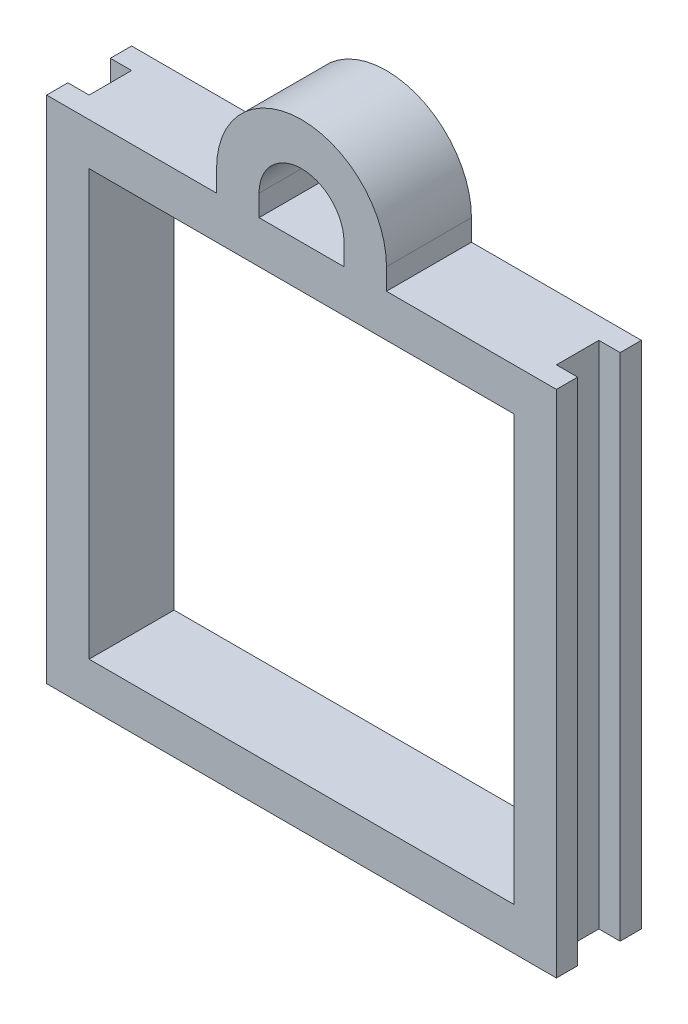
ISO-10303-21;
HEADER;
FILE_DESCRIPTION(('STEP AP214'),'2;1');
FILE_NAME('part.step','',(''),(''),'','','');
FILE_SCHEMA(('AUTOMOTIVE_DESIGN { 1 0 10303 214 1 1 1 1 }'));
ENDSEC;
DATA;
#1=APPLICATION_CONTEXT('core data for automotive mechanical design processes');
#2=APPLICATION_PROTOCOL_DEFINITION('international standard','automotive_design',2000,#1);
#3=PRODUCT_CONTEXT('',#1,'mechanical');
#4=PRODUCT('Part','Part','',(#3));
#5=PRODUCT_RELATED_PRODUCT_CATEGORY('part','',(#4));
#6=PRODUCT_DEFINITION_FORMATION('','',#4);
#7=PRODUCT_DEFINITION_CONTEXT('part definition',#1,'design');
#8=PRODUCT_DEFINITION('design','',#6,#7);
#9=PRODUCT_DEFINITION_SHAPE('','',#8);
#10=(LENGTH_UNIT() NAMED_UNIT(*) SI_UNIT(.MILLI.,.METRE.));
#11=(NAMED_UNIT(*) PLANE_ANGLE_UNIT() SI_UNIT($,.RADIAN.));
#12=(NAMED_UNIT(*) SI_UNIT($,.STERADIAN.) SOLID_ANGLE_UNIT());
#13=UNCERTAINTY_MEASURE_WITH_UNIT(LENGTH_MEASURE(1.E-05),#10,'distance_accuracy_value','');
#14=(GEOMETRIC_REPRESENTATION_CONTEXT(3) GLOBAL_UNCERTAINTY_ASSIGNED_CONTEXT((#13)) GLOBAL_UNIT_ASSIGNED_CONTEXT((#10,
#11,#12)) REPRESENTATION_CONTEXT('',''));
#15=CARTESIAN_POINT('',(0.,0.,0.));
#16=DIRECTION('',(0.,0.,1.));
#17=DIRECTION('',(1.,0.,0.));
#18=AXIS2_PLACEMENT_3D('',#15,#16,#17);
#19=CARTESIAN_POINT('',(0.,110.,-10.));
#20=DIRECTION('',(0.,-1.,0.));
#21=DIRECTION('',(0.,0.,-1.));
#22=AXIS2_PLACEMENT_3D('',#19,#20,#21);
#23=PLANE('',#22);
#24=DIRECTION('',(0.,0.,1.));
#25=VECTOR('',#24,1.);
#26=CARTESIAN_POINT('',(30.,110.,-10.));
#27=LINE('',#26,#25);
#28=CARTESIAN_POINT('',(30.,110.,-10.));
#29=VERTEX_POINT('',#28);
#30=CARTESIAN_POINT('',(30.,110.,10.));
#31=VERTEX_POINT('',#30);
#32=EDGE_CURVE('E199',#29,#31,#27,.T.);
#33=ORIENTED_EDGE('',*,*,#32,.F.);
#34=DIRECTION('',(1.,0.,0.));
#35=VECTOR('',#34,1.);
#36=CARTESIAN_POINT('',(0.,110.,-10.));
#37=LINE('',#36,#35);
#38=CARTESIAN_POINT('',(-10.,110.,-10.));
#39=VERTEX_POINT('',#38);
#40=EDGE_CURVE('E309',#39,#29,#37,.T.);
#41=ORIENTED_EDGE('',*,*,#40,.F.);
#42=DIRECTION('',(0.,0.,1.));
#43=VECTOR('',#42,1.);
#44=CARTESIAN_POINT('',(-10.,110.,-10.));
#45=LINE('',#44,#43);
#46=CARTESIAN_POINT('',(-10.,110.,-5.));
#47=VERTEX_POINT('',#46);
#48=EDGE_CURVE('E341',#39,#47,#45,.T.);
#49=ORIENTED_EDGE('',*,*,#48,.T.);
#50=DIRECTION('',(-1.,0.,0.));
#51=VECTOR('',#50,1.);
#52=CARTESIAN_POINT('',(-5.,110.,-5.));
#53=LINE('',#52,#51);
#54=CARTESIAN_POINT('',(-5.,110.,-5.));
#55=VERTEX_POINT('',#54);
#56=EDGE_CURVE('E274',#55,#47,#53,.T.);
#57=ORIENTED_EDGE('',*,*,#56,.F.);
#58=DIRECTION('',(0.,0.,-1.));
#59=VECTOR('',#58,1.);
#60=CARTESIAN_POINT('',(-5.,110.,-5.));
#61=LINE('',#60,#59);
#62=CARTESIAN_POINT('',(-5.,110.,5.));
#63=VERTEX_POINT('',#62);
#64=EDGE_CURVE('E263',#63,#55,#61,.T.);
#65=ORIENTED_EDGE('',*,*,#64,.F.);
#66=DIRECTION('',(-1.,0.,0.));
#67=VECTOR('',#66,1.);
#68=CARTESIAN_POINT('',(-5.,110.,5.));
#69=LINE('',#68,#67);
#70=CARTESIAN_POINT('',(-10.,110.,5.));
#71=VERTEX_POINT('',#70);
#72=EDGE_CURVE('E277',#63,#71,#69,.T.);
#73=ORIENTED_EDGE('',*,*,#72,.T.);
#74=CARTESIAN_POINT('',(-10.,110.,10.));
#75=VERTEX_POINT('',#74);
#76=EDGE_CURVE('E343',#71,#75,#45,.T.);
#77=ORIENTED_EDGE('',*,*,#76,.T.);
#78=DIRECTION('',(1.,0.,0.));
#79=VECTOR('',#78,1.);
#80=CARTESIAN_POINT('',(0.,110.,10.));
#81=LINE('',#80,#79);
#82=EDGE_CURVE('E188',#75,#31,#81,.T.);
#83=ORIENTED_EDGE('',*,*,#82,.T.);
#84=EDGE_LOOP('',(#33,#41,#49,#57,#65,#73,#77,#83));
#85=FACE_BOUND('',#84,.T.);
#86=ADVANCED_FACE('F16',(#85),#23,.F.);
#87=CARTESIAN_POINT('',(70.,110.,-10.));
#88=VERTEX_POINT('',#87);
#89=CARTESIAN_POINT('',(110.,110.,-10.));
#90=VERTEX_POINT('',#89);
#91=EDGE_CURVE('E33',#88,#90,#37,.T.);
#92=ORIENTED_EDGE('',*,*,#91,.F.);
#93=DIRECTION('',(0.,0.,1.));
#94=VECTOR('',#93,1.);
#95=CARTESIAN_POINT('',(70.,110.,-10.));
#96=LINE('',#95,#94);
#97=CARTESIAN_POINT('',(70.,110.,10.));
#98=VERTEX_POINT('',#97);
#99=EDGE_CURVE('E235',#88,#98,#96,.T.);
#100=ORIENTED_EDGE('',*,*,#99,.T.);
#101=CARTESIAN_POINT('',(110.,110.,10.));
#102=VERTEX_POINT('',#101);
#103=EDGE_CURVE('E189',#98,#102,#81,.T.);
#104=ORIENTED_EDGE('',*,*,#103,.T.);
#105=DIRECTION('',(0.,0.,1.));
#106=VECTOR('',#105,1.);
#107=CARTESIAN_POINT('',(110.,110.,-10.));
#108=LINE('',#107,#106);
#109=CARTESIAN_POINT('',(110.,110.,5.));
#110=VERTEX_POINT('',#109);
#111=EDGE_CURVE('E327',#110,#102,#108,.T.);
#112=ORIENTED_EDGE('',*,*,#111,.F.);
#113=DIRECTION('',(1.,0.,0.));
#114=VECTOR('',#113,1.);
#115=CARTESIAN_POINT('',(105.,110.,5.));
#116=LINE('',#115,#114);
#117=CARTESIAN_POINT('',(105.,110.,5.));
#118=VERTEX_POINT('',#117);
#119=EDGE_CURVE('E250',#118,#110,#116,.T.);
#120=ORIENTED_EDGE('',*,*,#119,.F.);
#121=DIRECTION('',(0.,0.,1.));
#122=VECTOR('',#121,1.);
#123=CARTESIAN_POINT('',(105.,110.,0.));
#124=LINE('',#123,#122);
#125=CARTESIAN_POINT('',(105.,110.,-5.));
#126=VERTEX_POINT('',#125);
#127=EDGE_CURVE('E239',#126,#118,#124,.T.);
#128=ORIENTED_EDGE('',*,*,#127,.F.);
#129=DIRECTION('',(1.,0.,0.));
#130=VECTOR('',#129,1.);
#131=CARTESIAN_POINT('',(105.,110.,-5.));
#132=LINE('',#131,#130);
#133=CARTESIAN_POINT('',(110.,110.,-5.));
#134=VERTEX_POINT('',#133);
#135=EDGE_CURVE('E253',#126,#134,#132,.T.);
#136=ORIENTED_EDGE('',*,*,#135,.T.);
#137=EDGE_CURVE('E20',#90,#134,#108,.T.);
#138=ORIENTED_EDGE('',*,*,#137,.F.);
#139=EDGE_LOOP('',(#92,#100,#104,#112,#120,#128,#136,#138));
#140=FACE_BOUND('',#139,.T.);
#141=ADVANCED_FACE('F376',(#140),#23,.F.);
#142=CARTESIAN_POINT('',(110.,0.,-10.));
#143=DIRECTION('',(-1.,0.,0.));
#144=DIRECTION('',(0.,0.,1.));
#145=AXIS2_PLACEMENT_3D('',#142,#143,#144);
#146=PLANE('',#145);
#147=ORIENTED_EDGE('',*,*,#137,.T.);
#148=DIRECTION('',(0.,1.,0.));
#149=VECTOR('',#148,1.);
#150=CARTESIAN_POINT('',(110.,0.,-5.));
#151=LINE('',#150,#149);
#152=CARTESIAN_POINT('',(110.,-10.,-5.));
#153=VERTEX_POINT('',#152);
#154=EDGE_CURVE('E243',#153,#134,#151,.T.);
#155=ORIENTED_EDGE('',*,*,#154,.F.);
#156=DIRECTION('',(0.,0.,1.));
#157=VECTOR('',#156,1.);
#158=CARTESIAN_POINT('',(110.,-10.,-10.));
#159=LINE('',#158,#157);
#160=CARTESIAN_POINT('',(110.,-10.,-10.));
#161=VERTEX_POINT('',#160);
#162=EDGE_CURVE('E334',#161,#153,#159,.T.);
#163=ORIENTED_EDGE('',*,*,#162,.F.);
#164=DIRECTION('',(0.,-1.,0.));
#165=VECTOR('',#164,1.);
#166=CARTESIAN_POINT('',(110.,0.,-10.));
#167=LINE('',#166,#165);
#168=EDGE_CURVE('E307',#90,#161,#167,.T.);
#169=ORIENTED_EDGE('',*,*,#168,.F.);
#170=EDGE_LOOP('',(#147,#155,#163,#169));
#171=FACE_BOUND('',#170,.T.);
#172=ADVANCED_FACE('F378',(#171),#146,.F.);
#173=CARTESIAN_POINT('',(-10.,0.,-10.));
#174=DIRECTION('',(-1.,0.,0.));
#175=DIRECTION('',(0.,-1.,0.));
#176=AXIS2_PLACEMENT_3D('',#173,#174,#175);
#177=PLANE('',#176);
#178=DIRECTION('',(0.,1.,0.));
#179=VECTOR('',#178,1.);
#180=CARTESIAN_POINT('',(-10.,110.,5.));
#181=LINE('',#180,#179);
#182=CARTESIAN_POINT('',(-10.,-10.,5.));
#183=VERTEX_POINT('',#182);
#184=EDGE_CURVE('E267',#183,#71,#181,.T.);
#185=ORIENTED_EDGE('',*,*,#184,.F.);
#186=DIRECTION('',(0.,0.,1.));
#187=VECTOR('',#186,1.);
#188=CARTESIAN_POINT('',(-10.,-10.,-10.));
#189=LINE('',#188,#187);
#190=CARTESIAN_POINT('',(-10.,-10.,10.));
#191=VERTEX_POINT('',#190);
#192=EDGE_CURVE('E340',#183,#191,#189,.T.);
#193=ORIENTED_EDGE('',*,*,#192,.T.);
#194=DIRECTION('',(0.,-1.,0.));
#195=VECTOR('',#194,1.);
#196=CARTESIAN_POINT('',(-10.,0.,10.));
#197=LINE('',#196,#195);
#198=EDGE_CURVE('E289',#75,#191,#197,.T.);
#199=ORIENTED_EDGE('',*,*,#198,.F.);
#200=ORIENTED_EDGE('',*,*,#76,.F.);
#201=EDGE_LOOP('',(#185,#193,#199,#200));
#202=FACE_BOUND('',#201,.T.);
#203=ADVANCED_FACE('F385',(#202),#177,.T.);
#204=CARTESIAN_POINT('',(100.,0.,-10.));
#205=DIRECTION('',(1.,0.,0.));
#206=DIRECTION('',(0.,0.,-1.));
#207=AXIS2_PLACEMENT_3D('',#204,#205,#206);
#208=PLANE('',#207);
#209=DIRECTION('',(0.,0.,1.));
#210=VECTOR('',#209,1.);
#211=CARTESIAN_POINT('',(100.,0.,-10.));
#212=LINE('',#211,#210);
#213=CARTESIAN_POINT('',(100.,0.,-10.));
#214=VERTEX_POINT('',#213);
#215=CARTESIAN_POINT('',(100.,0.,10.));
#216=VERTEX_POINT('',#215);
#217=EDGE_CURVE('E332',#214,#216,#212,.T.);
#218=ORIENTED_EDGE('',*,*,#217,.T.);
#219=DIRECTION('',(0.,1.,0.));
#220=VECTOR('',#219,1.);
#221=CARTESIAN_POINT('',(100.,0.,10.));
#222=LINE('',#221,#220);
#223=CARTESIAN_POINT('',(100.,100.,10.));
#224=VERTEX_POINT('',#223);
#225=EDGE_CURVE('E295',#216,#224,#222,.T.);
#226=ORIENTED_EDGE('',*,*,#225,.T.);
#227=DIRECTION('',(0.,0.,1.));
#228=VECTOR('',#227,1.);
#229=CARTESIAN_POINT('',(100.,100.,-10.));
#230=LINE('',#229,#228);
#231=CARTESIAN_POINT('',(100.,100.,-10.));
#232=VERTEX_POINT('',#231);
#233=EDGE_CURVE('E10',#232,#224,#230,.T.);
#234=ORIENTED_EDGE('',*,*,#233,.F.);
#235=DIRECTION('',(0.,1.,0.));
#236=VECTOR('',#235,1.);
#237=CARTESIAN_POINT('',(100.,0.,-10.));
#238=LINE('',#237,#236);
#239=EDGE_CURVE('E318',#214,#232,#238,.T.);
#240=ORIENTED_EDGE('',*,*,#239,.F.);
#241=EDGE_LOOP('',(#218,#226,#234,#240));
#242=FACE_BOUND('',#241,.T.);
#243=ADVANCED_FACE('F406',(#242),#208,.F.);
#244=CARTESIAN_POINT('',(0.,100.,-10.));
#245=DIRECTION('',(0.,-1.,0.));
#246=DIRECTION('',(0.,0.,-1.));
#247=AXIS2_PLACEMENT_3D('',#244,#245,#246);
#248=PLANE('',#247);
#249=ORIENTED_EDGE('',*,*,#233,.T.);
#250=DIRECTION('',(1.,0.,0.));
#251=VECTOR('',#250,1.);
#252=CARTESIAN_POINT('',(0.,100.,10.));
#253=LINE('',#252,#251);
#254=CARTESIAN_POINT('',(0.,100.,10.));
#255=VERTEX_POINT('',#254);
#256=EDGE_CURVE('E304',#255,#224,#253,.T.);
#257=ORIENTED_EDGE('',*,*,#256,.F.);
#258=DIRECTION('',(0.,0.,1.));
#259=VECTOR('',#258,1.);
#260=CARTESIAN_POINT('',(0.,100.,-10.));
#261=LINE('',#260,#259);
#262=CARTESIAN_POINT('',(0.,100.,-10.));
#263=VERTEX_POINT('',#262);
#264=EDGE_CURVE('E25',#263,#255,#261,.T.);
#265=ORIENTED_EDGE('',*,*,#264,.F.);
#266=DIRECTION('',(1.,0.,0.));
#267=VECTOR('',#266,1.);
#268=CARTESIAN_POINT('',(0.,100.,-10.));
#269=LINE('',#268,#267);
#270=EDGE_CURVE('E325',#263,#232,#269,.T.);
#271=ORIENTED_EDGE('',*,*,#270,.T.);
#272=EDGE_LOOP('',(#249,#257,#265,#271));
#273=FACE_BOUND('',#272,.T.);
#274=ADVANCED_FACE('F412',(#273),#248,.T.);
#275=CARTESIAN_POINT('',(0.,0.,-10.));
#276=DIRECTION('',(1.,0.,0.));
#277=DIRECTION('',(0.,0.,-1.));
#278=AXIS2_PLACEMENT_3D('',#275,#276,#277);
#279=PLANE('',#278);
#280=ORIENTED_EDGE('',*,*,#264,.T.);
#281=DIRECTION('',(0.,1.,0.));
#282=VECTOR('',#281,1.);
#283=CARTESIAN_POINT('',(0.,0.,10.));
#284=LINE('',#283,#282);
#285=CARTESIAN_POINT('',(0.,0.,10.));
#286=VERTEX_POINT('',#285);
#287=EDGE_CURVE('E301',#286,#255,#284,.T.);
#288=ORIENTED_EDGE('',*,*,#287,.F.);
#289=DIRECTION('',(0.,0.,1.));
#290=VECTOR('',#289,1.);
#291=CARTESIAN_POINT('',(0.,0.,-10.));
#292=LINE('',#291,#290);
#293=CARTESIAN_POINT('',(0.,0.,-10.));
#294=VERTEX_POINT('',#293);
#295=EDGE_CURVE('E330',#294,#286,#292,.T.);
#296=ORIENTED_EDGE('',*,*,#295,.F.);
#297=DIRECTION('',(0.,1.,0.));
#298=VECTOR('',#297,1.);
#299=CARTESIAN_POINT('',(0.,0.,-10.));
#300=LINE('',#299,#298);
#301=EDGE_CURVE('E322',#294,#263,#300,.T.);
#302=ORIENTED_EDGE('',*,*,#301,.T.);
#303=EDGE_LOOP('',(#280,#288,#296,#302));
#304=FACE_BOUND('',#303,.T.);
#305=ADVANCED_FACE('F456',(#304),#279,.T.);
#306=CARTESIAN_POINT('',(110.,-10.,5.));
#307=VERTEX_POINT('',#306);
#308=CARTESIAN_POINT('',(110.,-10.,10.));
#309=VERTEX_POINT('',#308);
#310=EDGE_CURVE('E337',#307,#309,#159,.T.);
#311=ORIENTED_EDGE('',*,*,#310,.F.);
#312=DIRECTION('',(0.,-1.,0.));
#313=VECTOR('',#312,1.);
#314=CARTESIAN_POINT('',(110.,0.,5.));
#315=LINE('',#314,#313);
#316=EDGE_CURVE('E227',#110,#307,#315,.T.);
#317=ORIENTED_EDGE('',*,*,#316,.F.);
#318=ORIENTED_EDGE('',*,*,#111,.T.);
#319=DIRECTION('',(0.,-1.,0.));
#320=VECTOR('',#319,1.);
#321=CARTESIAN_POINT('',(110.,0.,10.));
#322=LINE('',#321,#320);
#323=EDGE_CURVE('E280',#102,#309,#322,.T.);
#324=ORIENTED_EDGE('',*,*,#323,.T.);
#325=EDGE_LOOP('',(#311,#317,#318,#324));
#326=FACE_BOUND('',#325,.T.);
#327=ADVANCED_FACE('F18',(#326),#146,.F.);
#328=CARTESIAN_POINT('',(0.,-10.,-10.));
#329=DIRECTION('',(0.,-1.,0.));
#330=DIRECTION('',(0.,0.,-1.));
#331=AXIS2_PLACEMENT_3D('',#328,#329,#330);
#332=PLANE('',#331);
#333=DIRECTION('',(1.,0.,0.));
#334=VECTOR('',#333,1.);
#335=CARTESIAN_POINT('',(105.,-10.,-5.));
#336=LINE('',#335,#334);
#337=CARTESIAN_POINT('',(105.,-10.,-5.));
#338=VERTEX_POINT('',#337);
#339=EDGE_CURVE('E257',#338,#153,#336,.T.);
#340=ORIENTED_EDGE('',*,*,#339,.F.);
#341=DIRECTION('',(0.,0.,-1.));
#342=VECTOR('',#341,1.);
#343=CARTESIAN_POINT('',(105.,-10.,0.));
#344=LINE('',#343,#342);
#345=CARTESIAN_POINT('',(105.,-10.,5.));
#346=VERTEX_POINT('',#345);
#347=EDGE_CURVE('E246',#346,#338,#344,.T.);
#348=ORIENTED_EDGE('',*,*,#347,.F.);
#349=DIRECTION('',(1.,0.,0.));
#350=VECTOR('',#349,1.);
#351=CARTESIAN_POINT('',(105.,-10.,5.));
#352=LINE('',#351,#350);
#353=EDGE_CURVE('E259',#346,#307,#352,.T.);
#354=ORIENTED_EDGE('',*,*,#353,.T.);
#355=ORIENTED_EDGE('',*,*,#310,.T.);
#356=DIRECTION('',(1.,0.,0.));
#357=VECTOR('',#356,1.);
#358=CARTESIAN_POINT('',(0.,-10.,10.));
#359=LINE('',#358,#357);
#360=EDGE_CURVE('E292',#191,#309,#359,.T.);
#361=ORIENTED_EDGE('',*,*,#360,.F.);
#362=ORIENTED_EDGE('',*,*,#192,.F.);
#363=DIRECTION('',(-1.,0.,0.));
#364=VECTOR('',#363,1.);
#365=CARTESIAN_POINT('',(-5.,-10.,5.));
#366=LINE('',#365,#364);
#367=CARTESIAN_POINT('',(-5.,-10.,5.));
#368=VERTEX_POINT('',#367);
#369=EDGE_CURVE('E281',#368,#183,#366,.T.);
#370=ORIENTED_EDGE('',*,*,#369,.F.);
#371=DIRECTION('',(0.,0.,1.));
#372=VECTOR('',#371,1.);
#373=CARTESIAN_POINT('',(-5.,-10.,-5.));
#374=LINE('',#373,#372);
#375=CARTESIAN_POINT('',(-5.,-10.,-5.));
#376=VERTEX_POINT('',#375);
#377=EDGE_CURVE('E270',#376,#368,#374,.T.);
#378=ORIENTED_EDGE('',*,*,#377,.F.);
#379=DIRECTION('',(-1.,0.,0.));
#380=VECTOR('',#379,1.);
#381=CARTESIAN_POINT('',(-5.,-10.,-5.));
#382=LINE('',#381,#380);
#383=CARTESIAN_POINT('',(-10.,-10.,-5.));
#384=VERTEX_POINT('',#383);
#385=EDGE_CURVE('E283',#376,#384,#382,.T.);
#386=ORIENTED_EDGE('',*,*,#385,.T.);
#387=CARTESIAN_POINT('',(-10.,-10.,-10.));
#388=VERTEX_POINT('',#387);
#389=EDGE_CURVE('E338',#388,#384,#189,.T.);
#390=ORIENTED_EDGE('',*,*,#389,.F.);
#391=DIRECTION('',(1.,0.,0.));
#392=VECTOR('',#391,1.);
#393=CARTESIAN_POINT('',(0.,-10.,-10.));
#394=LINE('',#393,#392);
#395=EDGE_CURVE('E315',#388,#161,#394,.T.);
#396=ORIENTED_EDGE('',*,*,#395,.T.);
#397=ORIENTED_EDGE('',*,*,#162,.T.);
#398=EDGE_LOOP('',(#340,#348,#354,#355,#361,#362,#370,#378,#386,#390,#396,#397));
#399=FACE_BOUND('',#398,.T.);
#400=ADVANCED_FACE('F366',(#399),#332,.T.);
#401=DIRECTION('',(0.,-1.,0.));
#402=VECTOR('',#401,1.);
#403=CARTESIAN_POINT('',(-10.,110.,-5.));
#404=LINE('',#403,#402);
#405=EDGE_CURVE('E256',#47,#384,#404,.T.);
#406=ORIENTED_EDGE('',*,*,#405,.F.);
#407=ORIENTED_EDGE('',*,*,#48,.F.);
#408=DIRECTION('',(0.,-1.,0.));
#409=VECTOR('',#408,1.);
#410=CARTESIAN_POINT('',(-10.,0.,-10.));
#411=LINE('',#410,#409);
#412=EDGE_CURVE('E312',#39,#388,#411,.T.);
#413=ORIENTED_EDGE('',*,*,#412,.T.);
#414=ORIENTED_EDGE('',*,*,#389,.T.);
#415=EDGE_LOOP('',(#406,#407,#413,#414));
#416=FACE_BOUND('',#415,.T.);
#417=ADVANCED_FACE('F389',(#416),#177,.T.);
#418=CARTESIAN_POINT('',(40.,110.,-10.));
#419=VERTEX_POINT('',#418);
#420=CARTESIAN_POINT('',(60.,110.,-10.));
#421=VERTEX_POINT('',#420);
#422=EDGE_CURVE('E194',#419,#421,#37,.T.);
#423=ORIENTED_EDGE('',*,*,#422,.F.);
#424=DIRECTION('',(0.,0.,1.));
#425=VECTOR('',#424,1.);
#426=CARTESIAN_POINT('',(40.,110.,-10.));
#427=LINE('',#426,#425);
#428=CARTESIAN_POINT('',(40.,110.,10.));
#429=VERTEX_POINT('',#428);
#430=EDGE_CURVE('E192',#419,#429,#427,.T.);
#431=ORIENTED_EDGE('',*,*,#430,.T.);
#432=CARTESIAN_POINT('',(60.,110.,10.));
#433=VERTEX_POINT('',#432);
#434=EDGE_CURVE('E179',#429,#433,#81,.T.);
#435=ORIENTED_EDGE('',*,*,#434,.T.);
#436=DIRECTION('',(0.,0.,1.));
#437=VECTOR('',#436,1.);
#438=CARTESIAN_POINT('',(60.,110.,-10.));
#439=LINE('',#438,#437);
#440=EDGE_CURVE('E41',#421,#433,#439,.T.);
#441=ORIENTED_EDGE('',*,*,#440,.F.);
#442=EDGE_LOOP('',(#423,#431,#435,#441));
#443=FACE_BOUND('',#442,.T.);
#444=ADVANCED_FACE('F193',(#443),#23,.F.);
#445=CARTESIAN_POINT('',(0.,0.,-10.));
#446=DIRECTION('',(0.,-1.,0.));
#447=DIRECTION('',(0.,0.,-1.));
#448=AXIS2_PLACEMENT_3D('',#445,#446,#447);
#449=PLANE('',#448);
#450=ORIENTED_EDGE('',*,*,#295,.T.);
#451=DIRECTION('',(1.,0.,0.));
#452=VECTOR('',#451,1.);
#453=CARTESIAN_POINT('',(0.,0.,10.));
#454=LINE('',#453,#452);
#455=EDGE_CURVE('E298',#286,#216,#454,.T.);
#456=ORIENTED_EDGE('',*,*,#455,.T.);
#457=ORIENTED_EDGE('',*,*,#217,.F.);
#458=DIRECTION('',(1.,0.,0.));
#459=VECTOR('',#458,1.);
#460=CARTESIAN_POINT('',(0.,0.,-10.));
#461=LINE('',#460,#459);
#462=EDGE_CURVE('E320',#294,#214,#461,.T.);
#463=ORIENTED_EDGE('',*,*,#462,.F.);
#464=EDGE_LOOP('',(#450,#456,#457,#463));
#465=FACE_BOUND('',#464,.T.);
#466=ADVANCED_FACE('F388',(#465),#449,.F.);
#467=CARTESIAN_POINT('',(0.,0.,-10.));
#468=DIRECTION('',(0.,0.,1.));
#469=DIRECTION('',(1.,0.,0.));
#470=AXIS2_PLACEMENT_3D('',#467,#468,#469);
#471=PLANE('',#470);
#472=DIRECTION('',(0.,1.,0.));
#473=VECTOR('',#472,1.);
#474=CARTESIAN_POINT('',(40.,0.,-10.));
#475=LINE('',#474,#473);
#476=CARTESIAN_POINT('',(40.,115.,-10.));
#477=VERTEX_POINT('',#476);
#478=EDGE_CURVE('E224',#419,#477,#475,.T.);
#479=ORIENTED_EDGE('',*,*,#478,.F.);
#480=ORIENTED_EDGE('',*,*,#422,.T.);
#481=DIRECTION('',(0.,-1.,0.));
#482=VECTOR('',#481,1.);
#483=CARTESIAN_POINT('',(60.,-1.66533453693772E-13,-10.));
#484=LINE('',#483,#482);
#485=CARTESIAN_POINT('',(60.,115.,-10.));
#486=VERTEX_POINT('',#485);
#487=EDGE_CURVE('E207',#486,#421,#484,.T.);
#488=ORIENTED_EDGE('',*,*,#487,.F.);
#489=CARTESIAN_POINT('',(50.,115.,-10.));
#490=DIRECTION('',(0.,0.,1.));
#491=DIRECTION('',(1.,0.,0.));
#492=AXIS2_PLACEMENT_3D('',#489,#490,#491);
#493=CIRCLE('',#492,10.);
#494=EDGE_CURVE('E204',#486,#477,#493,.T.);
#495=ORIENTED_EDGE('',*,*,#494,.T.);
#496=EDGE_LOOP('',(#479,#480,#488,#495));
#497=FACE_BOUND('',#496,.T.);
#498=ORIENTED_EDGE('',*,*,#168,.T.);
#499=ORIENTED_EDGE('',*,*,#395,.F.);
#500=ORIENTED_EDGE('',*,*,#412,.F.);
#501=ORIENTED_EDGE('',*,*,#40,.T.);
#502=DIRECTION('',(0.,1.,0.));
#503=VECTOR('',#502,1.);
#504=CARTESIAN_POINT('',(30.,0.,-10.));
#505=LINE('',#504,#503);
#506=CARTESIAN_POINT('',(30.,115.,-10.));
#507=VERTEX_POINT('',#506);
#508=EDGE_CURVE('E222',#29,#507,#505,.T.);
#509=ORIENTED_EDGE('',*,*,#508,.T.);
#510=CARTESIAN_POINT('',(50.,115.,-10.));
#511=DIRECTION('',(0.,0.,1.));
#512=DIRECTION('',(1.,0.,0.));
#513=AXIS2_PLACEMENT_3D('',#510,#511,#512);
#514=CIRCLE('',#513,20.);
#515=CARTESIAN_POINT('',(70.,115.,-10.));
#516=VERTEX_POINT('',#515);
#517=EDGE_CURVE('E220',#507,#516,#514,.F.);
#518=ORIENTED_EDGE('',*,*,#517,.T.);
#519=DIRECTION('',(0.,1.,0.));
#520=VECTOR('',#519,1.);
#521=CARTESIAN_POINT('',(70.,0.,-10.));
#522=LINE('',#521,#520);
#523=EDGE_CURVE('E217',#88,#516,#522,.T.);
#524=ORIENTED_EDGE('',*,*,#523,.F.);
#525=ORIENTED_EDGE('',*,*,#91,.T.);
#526=EDGE_LOOP('',(#498,#499,#500,#501,#509,#518,#524,#525));
#527=FACE_BOUND('',#526,.T.);
#528=ORIENTED_EDGE('',*,*,#239,.T.);
#529=ORIENTED_EDGE('',*,*,#270,.F.);
#530=ORIENTED_EDGE('',*,*,#301,.F.);
#531=ORIENTED_EDGE('',*,*,#462,.T.);
#532=EDGE_LOOP('',(#528,#529,#530,#531));
#533=FACE_BOUND('',#532,.T.);
#534=ADVANCED_FACE('F395',(#497,#527,#533),#471,.F.);
#535=CARTESIAN_POINT('',(0.,0.,10.));
#536=DIRECTION('',(0.,0.,1.));
#537=DIRECTION('',(1.,0.,0.));
#538=AXIS2_PLACEMENT_3D('',#535,#536,#537);
#539=PLANE('',#538);
#540=ORIENTED_EDGE('',*,*,#434,.F.);
#541=DIRECTION('',(0.,1.,0.));
#542=VECTOR('',#541,1.);
#543=CARTESIAN_POINT('',(40.,0.,10.));
#544=LINE('',#543,#542);
#545=CARTESIAN_POINT('',(40.,115.,10.));
#546=VERTEX_POINT('',#545);
#547=EDGE_CURVE('E185',#429,#546,#544,.T.);
#548=ORIENTED_EDGE('',*,*,#547,.T.);
#549=CARTESIAN_POINT('',(50.,115.,10.));
#550=DIRECTION('',(0.,0.,1.));
#551=DIRECTION('',(1.,0.,0.));
#552=AXIS2_PLACEMENT_3D('',#549,#550,#551);
#553=CIRCLE('',#552,10.);
#554=CARTESIAN_POINT('',(60.,115.,10.));
#555=VERTEX_POINT('',#554);
#556=EDGE_CURVE('E212',#555,#546,#553,.T.);
#557=ORIENTED_EDGE('',*,*,#556,.F.);
#558=DIRECTION('',(0.,-1.,0.));
#559=VECTOR('',#558,1.);
#560=CARTESIAN_POINT('',(60.,-1.66533453693772E-13,10.));
#561=LINE('',#560,#559);
#562=EDGE_CURVE('E187',#555,#433,#561,.T.);
#563=ORIENTED_EDGE('',*,*,#562,.T.);
#564=EDGE_LOOP('',(#540,#548,#557,#563));
#565=FACE_BOUND('',#564,.T.);
#566=ORIENTED_EDGE('',*,*,#323,.F.);
#567=ORIENTED_EDGE('',*,*,#103,.F.);
#568=DIRECTION('',(0.,1.,0.));
#569=VECTOR('',#568,1.);
#570=CARTESIAN_POINT('',(70.,0.,10.));
#571=LINE('',#570,#569);
#572=CARTESIAN_POINT('',(70.,115.,10.));
#573=VERTEX_POINT('',#572);
#574=EDGE_CURVE('E205',#98,#573,#571,.T.);
#575=ORIENTED_EDGE('',*,*,#574,.T.);
#576=CARTESIAN_POINT('',(50.,115.,10.));
#577=DIRECTION('',(0.,0.,1.));
#578=DIRECTION('',(1.,0.,0.));
#579=AXIS2_PLACEMENT_3D('',#576,#577,#578);
#580=CIRCLE('',#579,20.);
#581=CARTESIAN_POINT('',(30.,115.,10.));
#582=VERTEX_POINT('',#581);
#583=EDGE_CURVE('E620',#582,#573,#580,.F.);
#584=ORIENTED_EDGE('',*,*,#583,.F.);
#585=DIRECTION('',(0.,1.,0.));
#586=VECTOR('',#585,1.);
#587=CARTESIAN_POINT('',(30.,0.,10.));
#588=LINE('',#587,#586);
#589=EDGE_CURVE('E622',#31,#582,#588,.T.);
#590=ORIENTED_EDGE('',*,*,#589,.F.);
#591=ORIENTED_EDGE('',*,*,#82,.F.);
#592=ORIENTED_EDGE('',*,*,#198,.T.);
#593=ORIENTED_EDGE('',*,*,#360,.T.);
#594=EDGE_LOOP('',(#566,#567,#575,#584,#590,#591,#592,#593));
#595=FACE_BOUND('',#594,.T.);
#596=ORIENTED_EDGE('',*,*,#225,.F.);
#597=ORIENTED_EDGE('',*,*,#455,.F.);
#598=ORIENTED_EDGE('',*,*,#287,.T.);
#599=ORIENTED_EDGE('',*,*,#256,.T.);
#600=EDGE_LOOP('',(#596,#597,#598,#599));
#601=FACE_BOUND('',#600,.T.);
#602=ADVANCED_FACE('F181',(#565,#595,#601),#539,.T.);
#603=CARTESIAN_POINT('',(-5.,110.,5.));
#604=DIRECTION('',(0.,0.,1.));
#605=DIRECTION('',(0.,-1.,0.));
#606=AXIS2_PLACEMENT_3D('',#603,#604,#605);
#607=PLANE('',#606);
#608=ORIENTED_EDGE('',*,*,#184,.T.);
#609=ORIENTED_EDGE('',*,*,#72,.F.);
#610=DIRECTION('',(0.,1.,0.));
#611=VECTOR('',#610,1.);
#612=CARTESIAN_POINT('',(-5.,110.,5.));
#613=LINE('',#612,#611);
#614=EDGE_CURVE('E272',#368,#63,#613,.T.);
#615=ORIENTED_EDGE('',*,*,#614,.F.);
#616=ORIENTED_EDGE('',*,*,#369,.T.);
#617=EDGE_LOOP('',(#608,#609,#615,#616));
#618=FACE_BOUND('',#617,.T.);
#619=ADVANCED_FACE('F418',(#618),#607,.F.);
#620=CARTESIAN_POINT('',(-5.,110.,-5.));
#621=DIRECTION('',(0.,0.,-1.));
#622=DIRECTION('',(0.,1.,0.));
#623=AXIS2_PLACEMENT_3D('',#620,#621,#622);
#624=PLANE('',#623);
#625=ORIENTED_EDGE('',*,*,#405,.T.);
#626=ORIENTED_EDGE('',*,*,#385,.F.);
#627=DIRECTION('',(0.,-1.,0.));
#628=VECTOR('',#627,1.);
#629=CARTESIAN_POINT('',(-5.,110.,-5.));
#630=LINE('',#629,#628);
#631=EDGE_CURVE('E266',#55,#376,#630,.T.);
#632=ORIENTED_EDGE('',*,*,#631,.F.);
#633=ORIENTED_EDGE('',*,*,#56,.T.);
#634=EDGE_LOOP('',(#625,#626,#632,#633));
#635=FACE_BOUND('',#634,.T.);
#636=ADVANCED_FACE('F440',(#635),#624,.F.);
#637=CARTESIAN_POINT('',(-5.,0.,0.));
#638=DIRECTION('',(1.,0.,0.));
#639=DIRECTION('',(0.,1.,0.));
#640=AXIS2_PLACEMENT_3D('',#637,#638,#639);
#641=PLANE('',#640);
#642=ORIENTED_EDGE('',*,*,#64,.T.);
#643=ORIENTED_EDGE('',*,*,#631,.T.);
#644=ORIENTED_EDGE('',*,*,#377,.T.);
#645=ORIENTED_EDGE('',*,*,#614,.T.);
#646=EDGE_LOOP('',(#642,#643,#644,#645));
#647=FACE_BOUND('',#646,.T.);
#648=ADVANCED_FACE('F422',(#647),#641,.F.);
#649=CARTESIAN_POINT('',(105.,0.,-5.));
#650=DIRECTION('',(0.,0.,-1.));
#651=DIRECTION('',(0.,1.,0.));
#652=AXIS2_PLACEMENT_3D('',#649,#650,#651);
#653=PLANE('',#652);
#654=ORIENTED_EDGE('',*,*,#154,.T.);
#655=ORIENTED_EDGE('',*,*,#135,.F.);
#656=DIRECTION('',(0.,1.,0.));
#657=VECTOR('',#656,1.);
#658=CARTESIAN_POINT('',(105.,0.,-5.));
#659=LINE('',#658,#657);
#660=EDGE_CURVE('E248',#338,#126,#659,.T.);
#661=ORIENTED_EDGE('',*,*,#660,.F.);
#662=ORIENTED_EDGE('',*,*,#339,.T.);
#663=EDGE_LOOP('',(#654,#655,#661,#662));
#664=FACE_BOUND('',#663,.T.);
#665=ADVANCED_FACE('F431',(#664),#653,.F.);
#666=CARTESIAN_POINT('',(105.,0.,5.));
#667=DIRECTION('',(0.,0.,1.));
#668=DIRECTION('',(1.,0.,0.));
#669=AXIS2_PLACEMENT_3D('',#666,#667,#668);
#670=PLANE('',#669);
#671=ORIENTED_EDGE('',*,*,#316,.T.);
#672=ORIENTED_EDGE('',*,*,#353,.F.);
#673=DIRECTION('',(0.,-1.,0.));
#674=VECTOR('',#673,1.);
#675=CARTESIAN_POINT('',(105.,0.,5.));
#676=LINE('',#675,#674);
#677=EDGE_CURVE('E242',#118,#346,#676,.T.);
#678=ORIENTED_EDGE('',*,*,#677,.F.);
#679=ORIENTED_EDGE('',*,*,#119,.T.);
#680=EDGE_LOOP('',(#671,#672,#678,#679));
#681=FACE_BOUND('',#680,.T.);
#682=ADVANCED_FACE('F370',(#681),#670,.F.);
#683=CARTESIAN_POINT('',(105.,0.,0.));
#684=DIRECTION('',(1.,0.,0.));
#685=DIRECTION('',(0.,0.,-1.));
#686=AXIS2_PLACEMENT_3D('',#683,#684,#685);
#687=PLANE('',#686);
#688=ORIENTED_EDGE('',*,*,#127,.T.);
#689=ORIENTED_EDGE('',*,*,#677,.T.);
#690=ORIENTED_EDGE('',*,*,#347,.T.);
#691=ORIENTED_EDGE('',*,*,#660,.T.);
#692=EDGE_LOOP('',(#688,#689,#690,#691));
#693=FACE_BOUND('',#692,.T.);
#694=ADVANCED_FACE('F372',(#693),#687,.T.);
#695=CARTESIAN_POINT('',(50.,115.,-10.));
#696=DIRECTION('',(0.,0.,1.));
#697=DIRECTION('',(1.,0.,0.));
#698=AXIS2_PLACEMENT_3D('',#695,#696,#697);
#699=CYLINDRICAL_SURFACE('',#698,10.);
#700=DIRECTION('',(0.,0.,1.));
#701=VECTOR('',#700,1.);
#702=CARTESIAN_POINT('',(60.,115.,-10.));
#703=LINE('',#702,#701);
#704=EDGE_CURVE('E226',#486,#555,#703,.T.);
#705=ORIENTED_EDGE('',*,*,#704,.T.);
#706=ORIENTED_EDGE('',*,*,#556,.T.);
#707=DIRECTION('',(0.,0.,1.));
#708=VECTOR('',#707,1.);
#709=CARTESIAN_POINT('',(40.,115.,-10.));
#710=LINE('',#709,#708);
#711=EDGE_CURVE('E198',#477,#546,#710,.T.);
#712=ORIENTED_EDGE('',*,*,#711,.F.);
#713=ORIENTED_EDGE('',*,*,#494,.F.);
#714=EDGE_LOOP('',(#705,#706,#712,#713));
#715=FACE_BOUND('',#714,.T.);
#716=ADVANCED_FACE('F550',(#715),#699,.F.);
#717=CARTESIAN_POINT('',(40.,0.,-10.));
#718=DIRECTION('',(1.,0.,0.));
#719=DIRECTION('',(0.,1.,0.));
#720=AXIS2_PLACEMENT_3D('',#717,#718,#719);
#721=PLANE('',#720);
#722=ORIENTED_EDGE('',*,*,#711,.T.);
#723=ORIENTED_EDGE('',*,*,#547,.F.);
#724=ORIENTED_EDGE('',*,*,#430,.F.);
#725=ORIENTED_EDGE('',*,*,#478,.T.);
#726=EDGE_LOOP('',(#722,#723,#724,#725));
#727=FACE_BOUND('',#726,.T.);
#728=ADVANCED_FACE('F201',(#727),#721,.T.);
#729=CARTESIAN_POINT('',(30.,0.,-10.));
#730=DIRECTION('',(1.,0.,0.));
#731=DIRECTION('',(0.,0.,-1.));
#732=AXIS2_PLACEMENT_3D('',#729,#730,#731);
#733=PLANE('',#732);
#734=ORIENTED_EDGE('',*,*,#32,.T.);
#735=ORIENTED_EDGE('',*,*,#589,.T.);
#736=DIRECTION('',(0.,0.,1.));
#737=VECTOR('',#736,1.);
#738=CARTESIAN_POINT('',(30.,115.,-10.));
#739=LINE('',#738,#737);
#740=EDGE_CURVE('E231',#507,#582,#739,.T.);
#741=ORIENTED_EDGE('',*,*,#740,.F.);
#742=ORIENTED_EDGE('',*,*,#508,.F.);
#743=EDGE_LOOP('',(#734,#735,#741,#742));
#744=FACE_BOUND('',#743,.T.);
#745=ADVANCED_FACE('F566',(#744),#733,.F.);
#746=CARTESIAN_POINT('',(50.,115.,-10.));
#747=DIRECTION('',(0.,0.,1.));
#748=DIRECTION('',(1.,0.,0.));
#749=AXIS2_PLACEMENT_3D('',#746,#747,#748);
#750=CYLINDRICAL_SURFACE('',#749,20.);
#751=ORIENTED_EDGE('',*,*,#740,.T.);
#752=ORIENTED_EDGE('',*,*,#583,.T.);
#753=DIRECTION('',(0.,0.,1.));
#754=VECTOR('',#753,1.);
#755=CARTESIAN_POINT('',(70.,115.,-10.));
#756=LINE('',#755,#754);
#757=EDGE_CURVE('E233',#516,#573,#756,.T.);
#758=ORIENTED_EDGE('',*,*,#757,.F.);
#759=ORIENTED_EDGE('',*,*,#517,.F.);
#760=EDGE_LOOP('',(#751,#752,#758,#759));
#761=FACE_BOUND('',#760,.T.);
#762=ADVANCED_FACE('F576',(#761),#750,.T.);
#763=CARTESIAN_POINT('',(70.,0.,-10.));
#764=DIRECTION('',(1.,0.,0.));
#765=DIRECTION('',(0.,0.,-1.));
#766=AXIS2_PLACEMENT_3D('',#763,#764,#765);
#767=PLANE('',#766);
#768=ORIENTED_EDGE('',*,*,#757,.T.);
#769=ORIENTED_EDGE('',*,*,#574,.F.);
#770=ORIENTED_EDGE('',*,*,#99,.F.);
#771=ORIENTED_EDGE('',*,*,#523,.T.);
#772=EDGE_LOOP('',(#768,#769,#770,#771));
#773=FACE_BOUND('',#772,.T.);
#774=ADVANCED_FACE('F586',(#773),#767,.T.);
#775=CARTESIAN_POINT('',(60.,-1.66533453693772E-13,-10.));
#776=DIRECTION('',(-1.,0.,0.));
#777=DIRECTION('',(0.,-1.,0.));
#778=AXIS2_PLACEMENT_3D('',#775,#776,#777);
#779=PLANE('',#778);
#780=ORIENTED_EDGE('',*,*,#440,.T.);
#781=ORIENTED_EDGE('',*,*,#562,.F.);
#782=ORIENTED_EDGE('',*,*,#704,.F.);
#783=ORIENTED_EDGE('',*,*,#487,.T.);
#784=EDGE_LOOP('',(#780,#781,#782,#783));
#785=FACE_BOUND('',#784,.T.);
#786=ADVANCED_FACE('F596',(#785),#779,.T.);
#787=CLOSED_SHELL('',(#86,#141,#172,#203,#243,#274,#305,#327,#400,#417,#444,#466,#534,#602,#619,
#636,#648,#665,#682,#694,#716,#728,#745,#762,#774,#786));
#788=MANIFOLD_SOLID_BREP('B1',#787);
#789=ADVANCED_BREP_SHAPE_REPRESENTATION('',(#18,#788),#14);
#790=SHAPE_DEFINITION_REPRESENTATION(#9,#789);
ENDSEC;
END-ISO-10303-21;
